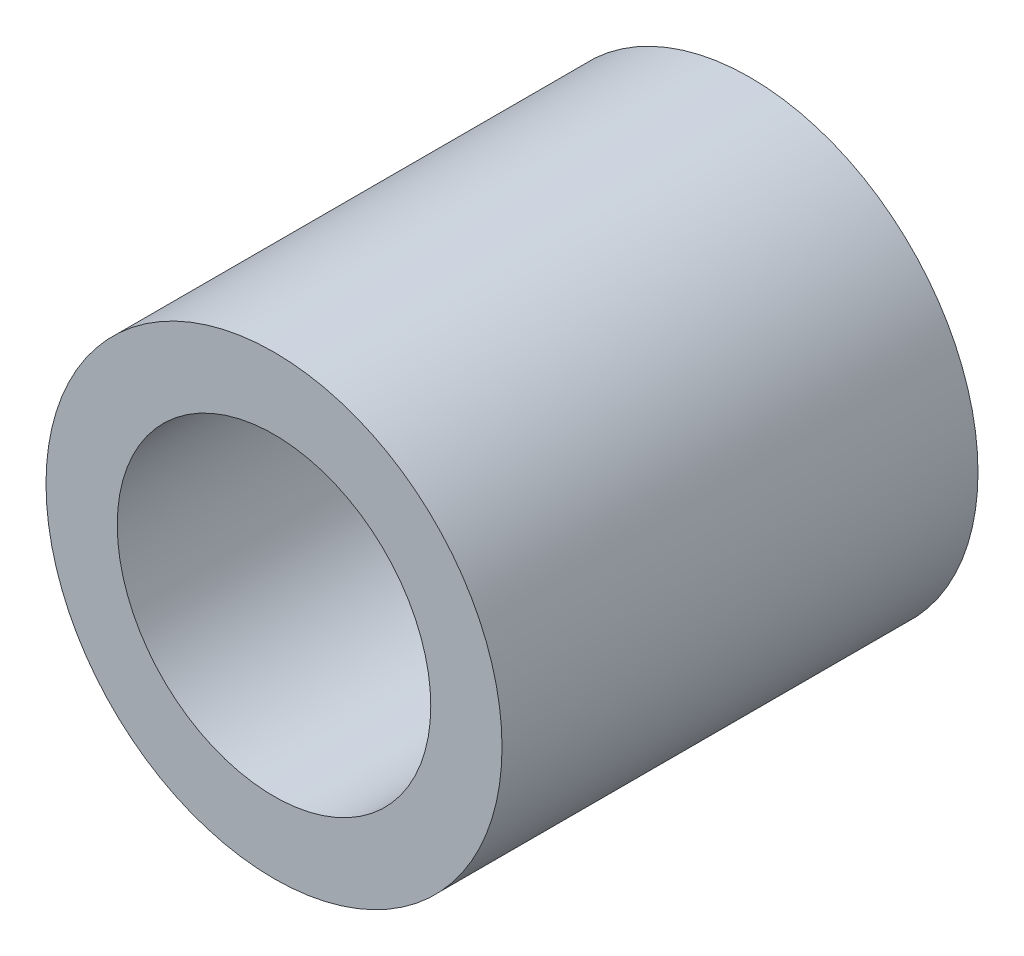
ISO-10303-21;
HEADER;
FILE_DESCRIPTION(('STEP AP214'),'2;1');
FILE_NAME('part.step','',(''),(''),'','','');
FILE_SCHEMA(('AUTOMOTIVE_DESIGN { 1 0 10303 214 1 1 1 1 }'));
ENDSEC;
DATA;
#1=APPLICATION_CONTEXT('core data for automotive mechanical design processes');
#2=APPLICATION_PROTOCOL_DEFINITION('international standard','automotive_design',2000,#1);
#3=PRODUCT_CONTEXT('',#1,'mechanical');
#4=PRODUCT('Part','Part','',(#3));
#5=PRODUCT_RELATED_PRODUCT_CATEGORY('part','',(#4));
#6=PRODUCT_DEFINITION_FORMATION('','',#4);
#7=PRODUCT_DEFINITION_CONTEXT('part definition',#1,'design');
#8=PRODUCT_DEFINITION('design','',#6,#7);
#9=PRODUCT_DEFINITION_SHAPE('','',#8);
#10=(LENGTH_UNIT() NAMED_UNIT(*) SI_UNIT(.MILLI.,.METRE.));
#11=(NAMED_UNIT(*) PLANE_ANGLE_UNIT() SI_UNIT($,.RADIAN.));
#12=(NAMED_UNIT(*) SI_UNIT($,.STERADIAN.) SOLID_ANGLE_UNIT());
#13=UNCERTAINTY_MEASURE_WITH_UNIT(LENGTH_MEASURE(1.E-05),#10,'distance_accuracy_value','');
#14=(GEOMETRIC_REPRESENTATION_CONTEXT(3) GLOBAL_UNCERTAINTY_ASSIGNED_CONTEXT((#13)) GLOBAL_UNIT_ASSIGNED_CONTEXT((#10,
#11,#12)) REPRESENTATION_CONTEXT('',''));
#15=CARTESIAN_POINT('',(0.,0.,0.));
#16=DIRECTION('',(0.,0.,1.));
#17=DIRECTION('',(1.,0.,0.));
#18=AXIS2_PLACEMENT_3D('',#15,#16,#17);
#19=CARTESIAN_POINT('',(0.,0.,0.));
#20=DIRECTION('',(0.,0.,1.));
#21=DIRECTION('',(1.,0.,0.));
#22=AXIS2_PLACEMENT_3D('',#19,#20,#21);
#23=CYLINDRICAL_SURFACE('',#22,2.75);
#24=CARTESIAN_POINT('',(0.,0.,8.35));
#25=DIRECTION('',(0.,0.,1.));
#26=DIRECTION('',(1.,0.,0.));
#27=AXIS2_PLACEMENT_3D('',#24,#25,#26);
#28=CIRCLE('',#27,2.75);
#29=CARTESIAN_POINT('',(2.75,0.,8.35));
#30=VERTEX_POINT('',#29);
#31=EDGE_CURVE('E18',#30,#30,#28,.F.);
#32=ORIENTED_EDGE('',*,*,#31,.F.);
#33=EDGE_LOOP('',(#32));
#34=FACE_BOUND('',#33,.T.);
#35=CARTESIAN_POINT('',(0.,0.,0.));
#36=DIRECTION('',(0.,0.,1.));
#37=DIRECTION('',(1.,0.,0.));
#38=AXIS2_PLACEMENT_3D('',#35,#36,#37);
#39=CIRCLE('',#38,2.75);
#40=CARTESIAN_POINT('',(2.75,0.,0.));
#41=VERTEX_POINT('',#40);
#42=EDGE_CURVE('E27',#41,#41,#39,.F.);
#43=ORIENTED_EDGE('',*,*,#42,.T.);
#44=EDGE_LOOP('',(#43));
#45=FACE_BOUND('',#44,.T.);
#46=ADVANCED_FACE('F15',(#34,#45),#23,.F.);
#47=CARTESIAN_POINT('',(0.,0.,8.35));
#48=DIRECTION('',(0.,0.,1.));
#49=DIRECTION('',(1.,0.,0.));
#50=AXIS2_PLACEMENT_3D('',#47,#48,#49);
#51=PLANE('',#50);
#52=ORIENTED_EDGE('',*,*,#31,.T.);
#53=EDGE_LOOP('',(#52));
#54=FACE_BOUND('',#53,.T.);
#55=CARTESIAN_POINT('',(0.,0.,8.35));
#56=DIRECTION('',(0.,0.,1.));
#57=DIRECTION('',(1.,0.,0.));
#58=AXIS2_PLACEMENT_3D('',#55,#56,#57);
#59=CIRCLE('',#58,4.);
#60=CARTESIAN_POINT('',(4.,0.,8.35));
#61=VERTEX_POINT('',#60);
#62=EDGE_CURVE('E22',#61,#61,#59,.F.);
#63=ORIENTED_EDGE('',*,*,#62,.F.);
#64=EDGE_LOOP('',(#63));
#65=FACE_BOUND('',#64,.T.);
#66=ADVANCED_FACE('F35',(#54,#65),#51,.T.);
#67=CARTESIAN_POINT('',(0.,0.,0.));
#68=DIRECTION('',(0.,0.,1.));
#69=DIRECTION('',(1.,0.,0.));
#70=AXIS2_PLACEMENT_3D('',#67,#68,#69);
#71=PLANE('',#70);
#72=ORIENTED_EDGE('',*,*,#42,.F.);
#73=EDGE_LOOP('',(#72));
#74=FACE_BOUND('',#73,.T.);
#75=CARTESIAN_POINT('',(0.,0.,0.));
#76=DIRECTION('',(0.,0.,1.));
#77=DIRECTION('',(1.,0.,0.));
#78=AXIS2_PLACEMENT_3D('',#75,#76,#77);
#79=CIRCLE('',#78,4.);
#80=CARTESIAN_POINT('',(4.,0.,0.));
#81=VERTEX_POINT('',#80);
#82=EDGE_CURVE('E9',#81,#81,#79,.T.);
#83=ORIENTED_EDGE('',*,*,#82,.F.);
#84=EDGE_LOOP('',(#83));
#85=FACE_BOUND('',#84,.T.);
#86=ADVANCED_FACE('F42',(#74,#85),#71,.F.);
#87=CARTESIAN_POINT('',(0.,0.,0.));
#88=DIRECTION('',(0.,0.,1.));
#89=DIRECTION('',(1.,0.,0.));
#90=AXIS2_PLACEMENT_3D('',#87,#88,#89);
#91=CYLINDRICAL_SURFACE('',#90,4.);
#92=ORIENTED_EDGE('',*,*,#62,.T.);
#93=EDGE_LOOP('',(#92));
#94=FACE_BOUND('',#93,.T.);
#95=ORIENTED_EDGE('',*,*,#82,.T.);
#96=EDGE_LOOP('',(#95));
#97=FACE_BOUND('',#96,.T.);
#98=ADVANCED_FACE('F43',(#94,#97),#91,.T.);
#99=CLOSED_SHELL('',(#46,#66,#86,#98));
#100=MANIFOLD_SOLID_BREP('B1',#99);
#101=ADVANCED_BREP_SHAPE_REPRESENTATION('',(#18,#100),#14);
#102=SHAPE_DEFINITION_REPRESENTATION(#9,#101);
ENDSEC;
END-ISO-10303-21;
